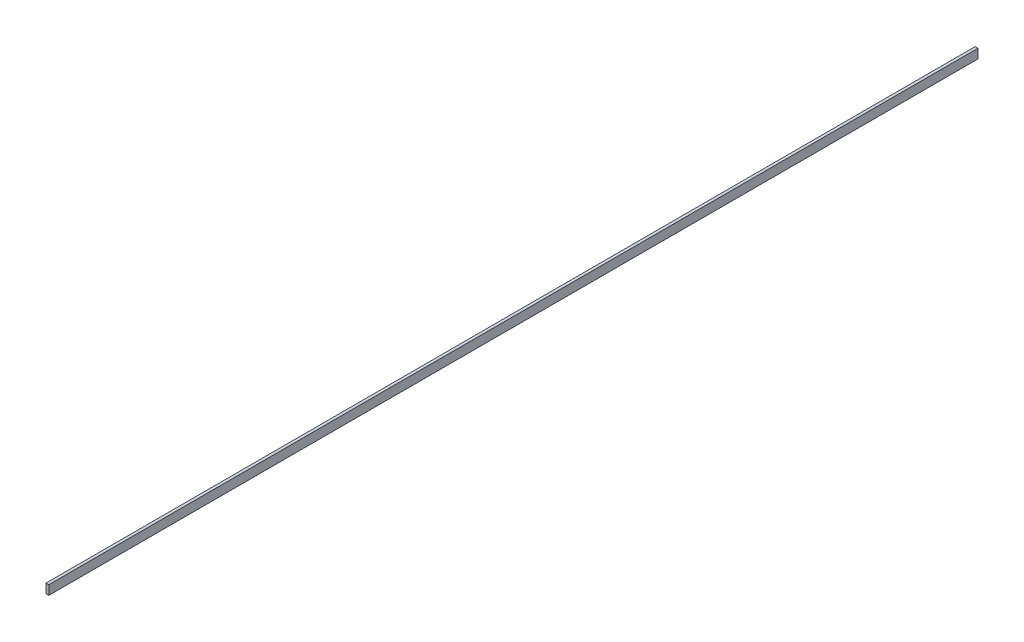
ISO-10303-21;
HEADER;
FILE_DESCRIPTION(('STEP AP214'),'2;1');
FILE_NAME('part.step','',(''),(''),'','','');
FILE_SCHEMA(('AUTOMOTIVE_DESIGN { 1 0 10303 214 1 1 1 1 }'));
ENDSEC;
DATA;
#1=APPLICATION_CONTEXT('core data for automotive mechanical design processes');
#2=APPLICATION_PROTOCOL_DEFINITION('international standard','automotive_design',2000,#1);
#3=PRODUCT_CONTEXT('',#1,'mechanical');
#4=PRODUCT('Part','Part','',(#3));
#5=PRODUCT_RELATED_PRODUCT_CATEGORY('part','',(#4));
#6=PRODUCT_DEFINITION_FORMATION('','',#4);
#7=PRODUCT_DEFINITION_CONTEXT('part definition',#1,'design');
#8=PRODUCT_DEFINITION('design','',#6,#7);
#9=PRODUCT_DEFINITION_SHAPE('','',#8);
#10=(LENGTH_UNIT() NAMED_UNIT(*) SI_UNIT(.MILLI.,.METRE.));
#11=(NAMED_UNIT(*) PLANE_ANGLE_UNIT() SI_UNIT($,.RADIAN.));
#12=(NAMED_UNIT(*) SI_UNIT($,.STERADIAN.) SOLID_ANGLE_UNIT());
#13=UNCERTAINTY_MEASURE_WITH_UNIT(LENGTH_MEASURE(1.E-05),#10,'distance_accuracy_value','');
#14=(GEOMETRIC_REPRESENTATION_CONTEXT(3) GLOBAL_UNCERTAINTY_ASSIGNED_CONTEXT((#13)) GLOBAL_UNIT_ASSIGNED_CONTEXT((#10,
#11,#12)) REPRESENTATION_CONTEXT('',''));
#15=CARTESIAN_POINT('',(0.,0.,0.));
#16=DIRECTION('',(0.,0.,1.));
#17=DIRECTION('',(1.,0.,0.));
#18=AXIS2_PLACEMENT_3D('',#15,#16,#17);
#19=CARTESIAN_POINT('',(0.,0.,-1000.));
#20=DIRECTION('',(-1.,0.,0.));
#21=DIRECTION('',(0.,-1.,0.));
#22=AXIS2_PLACEMENT_3D('',#19,#20,#21);
#23=PLANE('',#22);
#24=DIRECTION('',(0.,-1.,0.));
#25=VECTOR('',#24,1.);
#26=CARTESIAN_POINT('',(0.,0.,0.));
#27=LINE('',#26,#25);
#28=CARTESIAN_POINT('',(0.,0.,0.));
#29=VERTEX_POINT('',#28);
#30=CARTESIAN_POINT('',(0.,-10.,0.));
#31=VERTEX_POINT('',#30);
#32=EDGE_CURVE('E97',#29,#31,#27,.T.);
#33=ORIENTED_EDGE('',*,*,#32,.F.);
#34=DIRECTION('',(0.,0.,1.));
#35=VECTOR('',#34,1.);
#36=CARTESIAN_POINT('',(0.,0.,-1000.));
#37=LINE('',#36,#35);
#38=CARTESIAN_POINT('',(0.,0.,-1000.));
#39=VERTEX_POINT('',#38);
#40=EDGE_CURVE('E11',#39,#29,#37,.T.);
#41=ORIENTED_EDGE('',*,*,#40,.F.);
#42=DIRECTION('',(0.,-1.,0.));
#43=VECTOR('',#42,1.);
#44=CARTESIAN_POINT('',(0.,0.,-1000.));
#45=LINE('',#44,#43);
#46=CARTESIAN_POINT('',(0.,-10.,-1000.));
#47=VERTEX_POINT('',#46);
#48=EDGE_CURVE('E91',#39,#47,#45,.T.);
#49=ORIENTED_EDGE('',*,*,#48,.T.);
#50=DIRECTION('',(0.,0.,1.));
#51=VECTOR('',#50,1.);
#52=CARTESIAN_POINT('',(0.,-10.,-1000.));
#53=LINE('',#52,#51);
#54=EDGE_CURVE('E36',#47,#31,#53,.T.);
#55=ORIENTED_EDGE('',*,*,#54,.T.);
#56=EDGE_LOOP('',(#33,#41,#49,#55));
#57=FACE_BOUND('',#56,.T.);
#58=ADVANCED_FACE('F33',(#57),#23,.T.);
#59=CARTESIAN_POINT('',(0.,0.,-1000.));
#60=DIRECTION('',(0.,1.,0.));
#61=DIRECTION('',(0.,0.,1.));
#62=AXIS2_PLACEMENT_3D('',#59,#60,#61);
#63=PLANE('',#62);
#64=DIRECTION('',(-1.,0.,0.));
#65=VECTOR('',#64,1.);
#66=CARTESIAN_POINT('',(0.,0.,0.));
#67=LINE('',#66,#65);
#68=CARTESIAN_POINT('',(3.,0.,0.));
#69=VERTEX_POINT('',#68);
#70=EDGE_CURVE('E93',#69,#29,#67,.T.);
#71=ORIENTED_EDGE('',*,*,#70,.F.);
#72=DIRECTION('',(0.,0.,1.));
#73=VECTOR('',#72,1.);
#74=CARTESIAN_POINT('',(3.,0.,-1000.));
#75=LINE('',#74,#73);
#76=CARTESIAN_POINT('',(3.,0.,-1000.));
#77=VERTEX_POINT('',#76);
#78=EDGE_CURVE('E42',#77,#69,#75,.T.);
#79=ORIENTED_EDGE('',*,*,#78,.F.);
#80=DIRECTION('',(-1.,0.,0.));
#81=VECTOR('',#80,1.);
#82=CARTESIAN_POINT('',(0.,0.,-1000.));
#83=LINE('',#82,#81);
#84=EDGE_CURVE('E88',#77,#39,#83,.T.);
#85=ORIENTED_EDGE('',*,*,#84,.T.);
#86=ORIENTED_EDGE('',*,*,#40,.T.);
#87=EDGE_LOOP('',(#71,#79,#85,#86));
#88=FACE_BOUND('',#87,.T.);
#89=ADVANCED_FACE('F107',(#88),#63,.T.);
#90=CARTESIAN_POINT('',(3.,0.,-1000.));
#91=DIRECTION('',(1.,0.,0.));
#92=DIRECTION('',(0.,1.,0.));
#93=AXIS2_PLACEMENT_3D('',#90,#91,#92);
#94=PLANE('',#93);
#95=DIRECTION('',(0.,1.,0.));
#96=VECTOR('',#95,1.);
#97=CARTESIAN_POINT('',(3.,0.,0.));
#98=LINE('',#97,#96);
#99=CARTESIAN_POINT('',(3.,-10.,0.));
#100=VERTEX_POINT('',#99);
#101=EDGE_CURVE('E83',#100,#69,#98,.T.);
#102=ORIENTED_EDGE('',*,*,#101,.F.);
#103=DIRECTION('',(0.,0.,1.));
#104=VECTOR('',#103,1.);
#105=CARTESIAN_POINT('',(3.,-10.,-1000.));
#106=LINE('',#105,#104);
#107=CARTESIAN_POINT('',(3.,-10.,-1000.));
#108=VERTEX_POINT('',#107);
#109=EDGE_CURVE('E78',#108,#100,#106,.T.);
#110=ORIENTED_EDGE('',*,*,#109,.F.);
#111=DIRECTION('',(0.,1.,0.));
#112=VECTOR('',#111,1.);
#113=CARTESIAN_POINT('',(3.,0.,-1000.));
#114=LINE('',#113,#112);
#115=EDGE_CURVE('E81',#108,#77,#114,.T.);
#116=ORIENTED_EDGE('',*,*,#115,.T.);
#117=ORIENTED_EDGE('',*,*,#78,.T.);
#118=EDGE_LOOP('',(#102,#110,#116,#117));
#119=FACE_BOUND('',#118,.T.);
#120=ADVANCED_FACE('F80',(#119),#94,.T.);
#121=CARTESIAN_POINT('',(0.,-10.,-1000.));
#122=DIRECTION('',(0.,-1.,0.));
#123=DIRECTION('',(0.,0.,-1.));
#124=AXIS2_PLACEMENT_3D('',#121,#122,#123);
#125=PLANE('',#124);
#126=DIRECTION('',(1.,0.,0.));
#127=VECTOR('',#126,1.);
#128=CARTESIAN_POINT('',(0.,-10.,0.));
#129=LINE('',#128,#127);
#130=EDGE_CURVE('E100',#31,#100,#129,.T.);
#131=ORIENTED_EDGE('',*,*,#130,.F.);
#132=ORIENTED_EDGE('',*,*,#54,.F.);
#133=DIRECTION('',(1.,0.,0.));
#134=VECTOR('',#133,1.);
#135=CARTESIAN_POINT('',(0.,-10.,-1000.));
#136=LINE('',#135,#134);
#137=EDGE_CURVE('E87',#47,#108,#136,.T.);
#138=ORIENTED_EDGE('',*,*,#137,.T.);
#139=ORIENTED_EDGE('',*,*,#109,.T.);
#140=EDGE_LOOP('',(#131,#132,#138,#139));
#141=FACE_BOUND('',#140,.T.);
#142=ADVANCED_FACE('F90',(#141),#125,.T.);
#143=CARTESIAN_POINT('',(0.,0.,-1000.));
#144=DIRECTION('',(0.,0.,1.));
#145=DIRECTION('',(1.,0.,0.));
#146=AXIS2_PLACEMENT_3D('',#143,#144,#145);
#147=PLANE('',#146);
#148=ORIENTED_EDGE('',*,*,#48,.F.);
#149=ORIENTED_EDGE('',*,*,#84,.F.);
#150=ORIENTED_EDGE('',*,*,#115,.F.);
#151=ORIENTED_EDGE('',*,*,#137,.F.);
#152=EDGE_LOOP('',(#148,#149,#150,#151));
#153=FACE_BOUND('',#152,.T.);
#154=ADVANCED_FACE('F86',(#153),#147,.F.);
#155=CARTESIAN_POINT('',(0.,0.,0.));
#156=DIRECTION('',(0.,0.,1.));
#157=DIRECTION('',(1.,0.,0.));
#158=AXIS2_PLACEMENT_3D('',#155,#156,#157);
#159=PLANE('',#158);
#160=ORIENTED_EDGE('',*,*,#32,.T.);
#161=ORIENTED_EDGE('',*,*,#130,.T.);
#162=ORIENTED_EDGE('',*,*,#101,.T.);
#163=ORIENTED_EDGE('',*,*,#70,.T.);
#164=EDGE_LOOP('',(#160,#161,#162,#163));
#165=FACE_BOUND('',#164,.T.);
#166=ADVANCED_FACE('F106',(#165),#159,.T.);
#167=CLOSED_SHELL('',(#58,#89,#120,#142,#154,#166));
#168=MANIFOLD_SOLID_BREP('B2',#167);
#169=ADVANCED_BREP_SHAPE_REPRESENTATION('',(#18,#168),#14);
#170=SHAPE_DEFINITION_REPRESENTATION(#9,#169);
ENDSEC;
END-ISO-10303-21;
